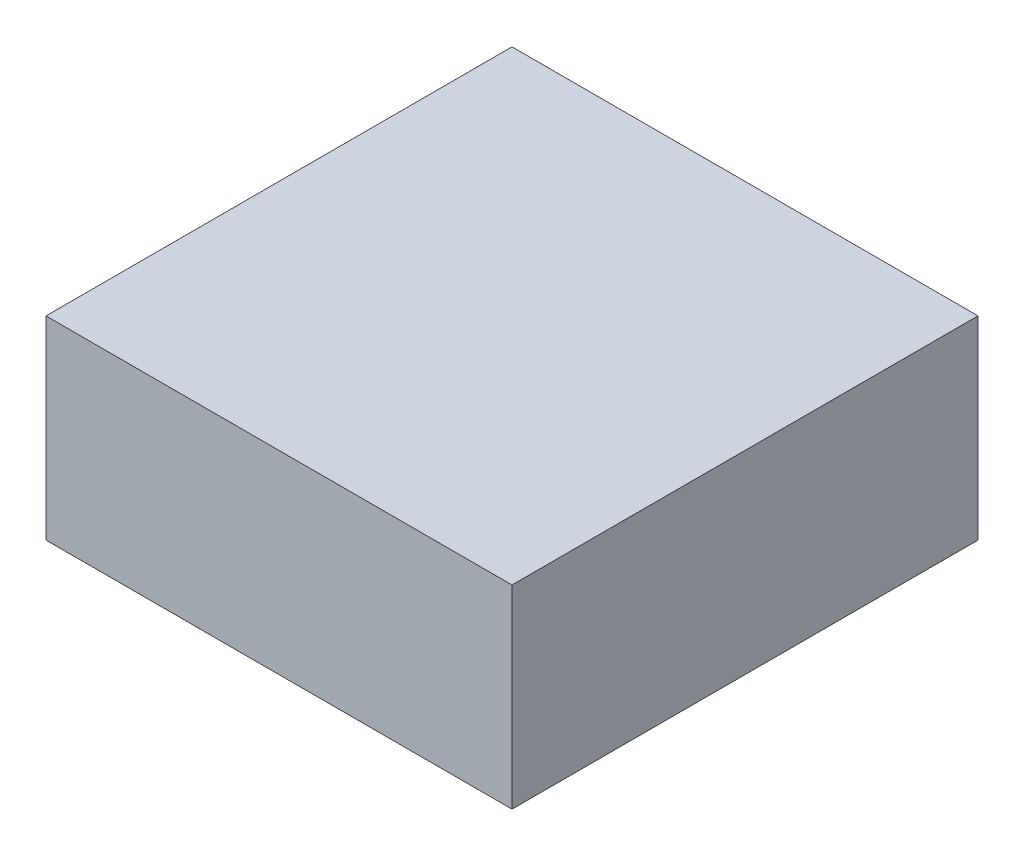
ISO-10303-21;
HEADER;
FILE_DESCRIPTION(('STEP AP214'),'2;1');
FILE_NAME('part.step','',(''),(''),'','','');
FILE_SCHEMA(('AUTOMOTIVE_DESIGN { 1 0 10303 214 1 1 1 1 }'));
ENDSEC;
DATA;
#1=APPLICATION_CONTEXT('core data for automotive mechanical design processes');
#2=APPLICATION_PROTOCOL_DEFINITION('international standard','automotive_design',2000,#1);
#3=PRODUCT_CONTEXT('',#1,'mechanical');
#4=PRODUCT('Part','Part','',(#3));
#5=PRODUCT_RELATED_PRODUCT_CATEGORY('part','',(#4));
#6=PRODUCT_DEFINITION_FORMATION('','',#4);
#7=PRODUCT_DEFINITION_CONTEXT('part definition',#1,'design');
#8=PRODUCT_DEFINITION('design','',#6,#7);
#9=PRODUCT_DEFINITION_SHAPE('','',#8);
#10=(LENGTH_UNIT() NAMED_UNIT(*) SI_UNIT(.MILLI.,.METRE.));
#11=(NAMED_UNIT(*) PLANE_ANGLE_UNIT() SI_UNIT($,.RADIAN.));
#12=(NAMED_UNIT(*) SI_UNIT($,.STERADIAN.) SOLID_ANGLE_UNIT());
#13=UNCERTAINTY_MEASURE_WITH_UNIT(LENGTH_MEASURE(1.E-05),#10,'distance_accuracy_value','');
#14=(GEOMETRIC_REPRESENTATION_CONTEXT(3) GLOBAL_UNCERTAINTY_ASSIGNED_CONTEXT((#13)) GLOBAL_UNIT_ASSIGNED_CONTEXT((#10,
#11,#12)) REPRESENTATION_CONTEXT('',''));
#15=CARTESIAN_POINT('',(0.,0.,0.));
#16=DIRECTION('',(0.,0.,1.));
#17=DIRECTION('',(1.,0.,0.));
#18=AXIS2_PLACEMENT_3D('',#15,#16,#17);
#19=CARTESIAN_POINT('',(0.2999994,0.12500102,0.));
#20=DIRECTION('',(0.,-1.,0.));
#21=DIRECTION('',(0.,0.,-1.));
#22=AXIS2_PLACEMENT_3D('',#19,#20,#21);
#23=PLANE('',#22);
#24=DIRECTION('',(0.,0.,-1.));
#25=VECTOR('',#24,1.);
#26=CARTESIAN_POINT('',(-0.2999994,0.12500102,0.));
#27=LINE('',#26,#25);
#28=CARTESIAN_POINT('',(-0.2999994,0.12500102,0.));
#29=VERTEX_POINT('',#28);
#30=CARTESIAN_POINT('',(-0.2999994,0.12500102,0.5999988));
#31=VERTEX_POINT('',#30);
#32=EDGE_CURVE('E20',#29,#31,#27,.F.);
#33=ORIENTED_EDGE('',*,*,#32,.T.);
#34=DIRECTION('',(-1.,0.,0.));
#35=VECTOR('',#34,1.);
#36=CARTESIAN_POINT('',(-0.2999994,0.12500102,0.5999988));
#37=LINE('',#36,#35);
#38=CARTESIAN_POINT('',(0.2999994,0.12500102,0.5999988));
#39=VERTEX_POINT('',#38);
#40=EDGE_CURVE('E55',#31,#39,#37,.F.);
#41=ORIENTED_EDGE('',*,*,#40,.T.);
#42=DIRECTION('',(0.,0.,1.));
#43=VECTOR('',#42,1.);
#44=CARTESIAN_POINT('',(0.2999994,0.12500102,0.));
#45=LINE('',#44,#43);
#46=CARTESIAN_POINT('',(0.2999994,0.12500102,0.));
#47=VERTEX_POINT('',#46);
#48=EDGE_CURVE('E76',#39,#47,#45,.F.);
#49=ORIENTED_EDGE('',*,*,#48,.T.);
#50=DIRECTION('',(-1.,0.,0.));
#51=VECTOR('',#50,1.);
#52=CARTESIAN_POINT('',(-0.2999994,0.12500102,0.));
#53=LINE('',#52,#51);
#54=EDGE_CURVE('E58',#29,#47,#53,.F.);
#55=ORIENTED_EDGE('',*,*,#54,.F.);
#56=EDGE_LOOP('',(#33,#41,#49,#55));
#57=FACE_BOUND('',#56,.T.);
#58=ADVANCED_FACE('F17',(#57),#23,.F.);
#59=CARTESIAN_POINT('',(-0.2999994,0.12500102,0.));
#60=DIRECTION('',(1.,0.,0.));
#61=DIRECTION('',(0.,0.,-1.));
#62=AXIS2_PLACEMENT_3D('',#59,#60,#61);
#63=PLANE('',#62);
#64=DIRECTION('',(0.,0.,1.));
#65=VECTOR('',#64,1.);
#66=CARTESIAN_POINT('',(-0.2999994,-0.12499848,0.));
#67=LINE('',#66,#65);
#68=CARTESIAN_POINT('',(-0.2999994,-0.12499848,0.));
#69=VERTEX_POINT('',#68);
#70=CARTESIAN_POINT('',(-0.2999994,-0.12499848,0.5999988));
#71=VERTEX_POINT('',#70);
#72=EDGE_CURVE('E73',#69,#71,#67,.T.);
#73=ORIENTED_EDGE('',*,*,#72,.T.);
#74=DIRECTION('',(0.,1.,0.));
#75=VECTOR('',#74,1.);
#76=CARTESIAN_POINT('',(-0.2999994,-0.12499848,0.5999988));
#77=LINE('',#76,#75);
#78=EDGE_CURVE('E63',#71,#31,#77,.T.);
#79=ORIENTED_EDGE('',*,*,#78,.T.);
#80=ORIENTED_EDGE('',*,*,#32,.F.);
#81=DIRECTION('',(0.,1.,0.));
#82=VECTOR('',#81,1.);
#83=CARTESIAN_POINT('',(-0.2999994,-0.12499848,0.));
#84=LINE('',#83,#82);
#85=EDGE_CURVE('E78',#69,#29,#84,.T.);
#86=ORIENTED_EDGE('',*,*,#85,.F.);
#87=EDGE_LOOP('',(#73,#79,#80,#86));
#88=FACE_BOUND('',#87,.T.);
#89=ADVANCED_FACE('F72',(#88),#63,.F.);
#90=CARTESIAN_POINT('',(-0.2999994,-0.12499848,0.5999988));
#91=DIRECTION('',(0.,0.,-1.));
#92=DIRECTION('',(-1.,0.,0.));
#93=AXIS2_PLACEMENT_3D('',#90,#91,#92);
#94=PLANE('',#93);
#95=DIRECTION('',(0.,1.,0.));
#96=VECTOR('',#95,1.);
#97=CARTESIAN_POINT('',(0.2999994,-0.12499848,0.5999988));
#98=LINE('',#97,#96);
#99=CARTESIAN_POINT('',(0.2999994,-0.12499848,0.5999988));
#100=VERTEX_POINT('',#99);
#101=EDGE_CURVE('E69',#100,#39,#98,.T.);
#102=ORIENTED_EDGE('',*,*,#101,.T.);
#103=ORIENTED_EDGE('',*,*,#40,.F.);
#104=ORIENTED_EDGE('',*,*,#78,.F.);
#105=DIRECTION('',(1.,0.,0.));
#106=VECTOR('',#105,1.);
#107=CARTESIAN_POINT('',(-0.2999994,-0.12499848,0.5999988));
#108=LINE('',#107,#106);
#109=EDGE_CURVE('E83',#71,#100,#108,.T.);
#110=ORIENTED_EDGE('',*,*,#109,.T.);
#111=EDGE_LOOP('',(#102,#103,#104,#110));
#112=FACE_BOUND('',#111,.T.);
#113=ADVANCED_FACE('F66',(#112),#94,.F.);
#114=CARTESIAN_POINT('',(0.2999994,-0.12499848,0.));
#115=DIRECTION('',(-1.,0.,0.));
#116=DIRECTION('',(0.,0.,1.));
#117=AXIS2_PLACEMENT_3D('',#114,#115,#116);
#118=PLANE('',#117);
#119=ORIENTED_EDGE('',*,*,#48,.F.);
#120=ORIENTED_EDGE('',*,*,#101,.F.);
#121=DIRECTION('',(0.,0.,1.));
#122=VECTOR('',#121,1.);
#123=CARTESIAN_POINT('',(0.2999994,-0.12499848,0.));
#124=LINE('',#123,#122);
#125=CARTESIAN_POINT('',(0.2999994,-0.12499848,0.));
#126=VERTEX_POINT('',#125);
#127=EDGE_CURVE('E26',#100,#126,#124,.F.);
#128=ORIENTED_EDGE('',*,*,#127,.T.);
#129=DIRECTION('',(0.,1.,0.));
#130=VECTOR('',#129,1.);
#131=CARTESIAN_POINT('',(0.2999994,-0.12499848,0.));
#132=LINE('',#131,#130);
#133=EDGE_CURVE('E34',#47,#126,#132,.F.);
#134=ORIENTED_EDGE('',*,*,#133,.F.);
#135=EDGE_LOOP('',(#119,#120,#128,#134));
#136=FACE_BOUND('',#135,.T.);
#137=ADVANCED_FACE('F88',(#136),#118,.F.);
#138=CARTESIAN_POINT('',(-0.2999994,-0.12499848,0.));
#139=DIRECTION('',(0.,0.,-1.));
#140=DIRECTION('',(-1.,0.,0.));
#141=AXIS2_PLACEMENT_3D('',#138,#139,#140);
#142=PLANE('',#141);
#143=ORIENTED_EDGE('',*,*,#133,.T.);
#144=DIRECTION('',(1.,0.,0.));
#145=VECTOR('',#144,1.);
#146=CARTESIAN_POINT('',(-0.2999994,-0.12499848,0.));
#147=LINE('',#146,#145);
#148=EDGE_CURVE('E11',#126,#69,#147,.F.);
#149=ORIENTED_EDGE('',*,*,#148,.T.);
#150=ORIENTED_EDGE('',*,*,#85,.T.);
#151=ORIENTED_EDGE('',*,*,#54,.T.);
#152=EDGE_LOOP('',(#143,#149,#150,#151));
#153=FACE_BOUND('',#152,.T.);
#154=ADVANCED_FACE('F91',(#153),#142,.T.);
#155=CARTESIAN_POINT('',(-0.2999994,-0.12499848,0.));
#156=DIRECTION('',(0.,1.,0.));
#157=DIRECTION('',(0.,0.,1.));
#158=AXIS2_PLACEMENT_3D('',#155,#156,#157);
#159=PLANE('',#158);
#160=ORIENTED_EDGE('',*,*,#127,.F.);
#161=ORIENTED_EDGE('',*,*,#109,.F.);
#162=ORIENTED_EDGE('',*,*,#72,.F.);
#163=ORIENTED_EDGE('',*,*,#148,.F.);
#164=EDGE_LOOP('',(#160,#161,#162,#163));
#165=FACE_BOUND('',#164,.T.);
#166=ADVANCED_FACE('F90',(#165),#159,.F.);
#167=CLOSED_SHELL('',(#58,#89,#113,#137,#154,#166));
#168=MANIFOLD_SOLID_BREP('B1',#167);
#169=ADVANCED_BREP_SHAPE_REPRESENTATION('',(#18,#168),#14);
#170=SHAPE_DEFINITION_REPRESENTATION(#9,#169);
ENDSEC;
END-ISO-10303-21;
